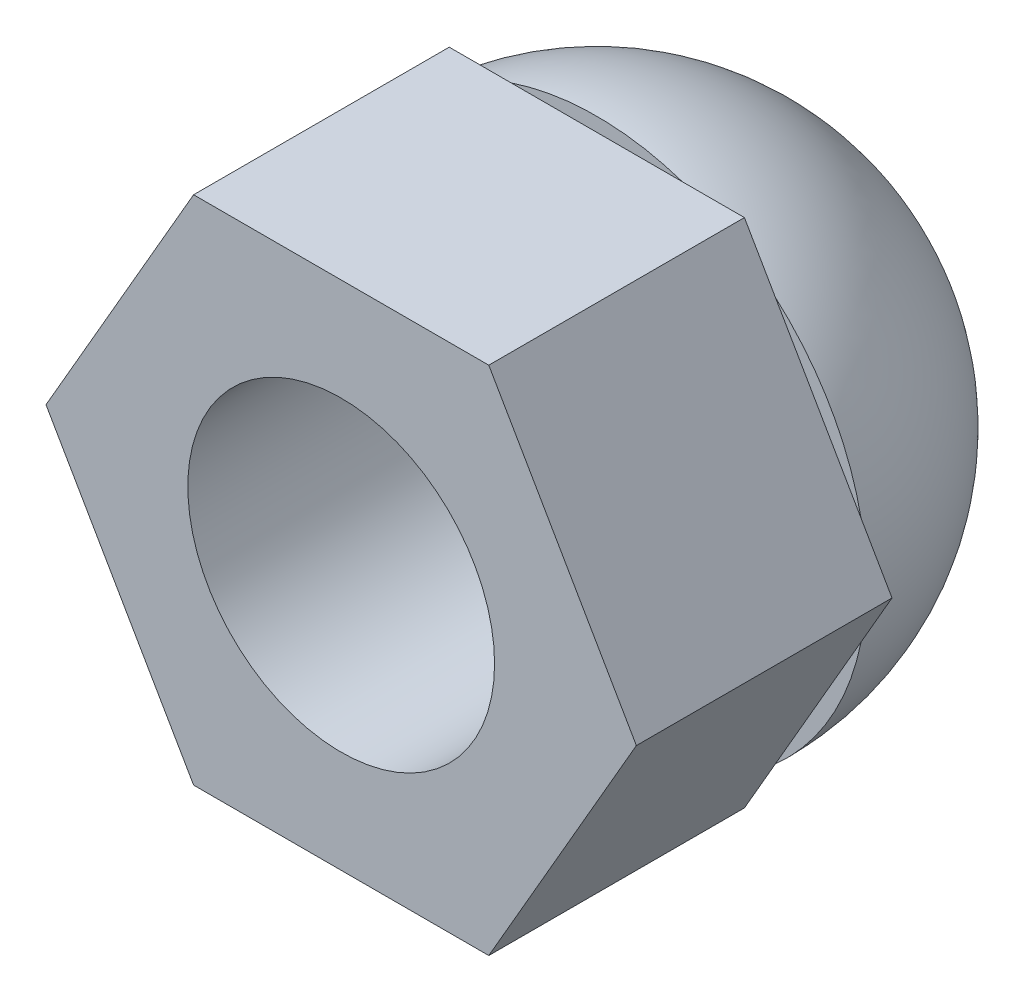
ISO-10303-21;
HEADER;
FILE_DESCRIPTION(('STEP AP214'),'2;1');
FILE_NAME('part.step','',(''),(''),'','','');
FILE_SCHEMA(('AUTOMOTIVE_DESIGN { 1 0 10303 214 1 1 1 1 }'));
ENDSEC;
DATA;
#1=APPLICATION_CONTEXT('core data for automotive mechanical design processes');
#2=APPLICATION_PROTOCOL_DEFINITION('international standard','automotive_design',2000,#1);
#3=PRODUCT_CONTEXT('',#1,'mechanical');
#4=PRODUCT('Part','Part','',(#3));
#5=PRODUCT_RELATED_PRODUCT_CATEGORY('part','',(#4));
#6=PRODUCT_DEFINITION_FORMATION('','',#4);
#7=PRODUCT_DEFINITION_CONTEXT('part definition',#1,'design');
#8=PRODUCT_DEFINITION('design','',#6,#7);
#9=PRODUCT_DEFINITION_SHAPE('','',#8);
#10=(LENGTH_UNIT() NAMED_UNIT(*) SI_UNIT(.MILLI.,.METRE.));
#11=(NAMED_UNIT(*) PLANE_ANGLE_UNIT() SI_UNIT($,.RADIAN.));
#12=(NAMED_UNIT(*) SI_UNIT($,.STERADIAN.) SOLID_ANGLE_UNIT());
#13=UNCERTAINTY_MEASURE_WITH_UNIT(LENGTH_MEASURE(1.E-05),#10,'distance_accuracy_value','');
#14=(GEOMETRIC_REPRESENTATION_CONTEXT(3) GLOBAL_UNCERTAINTY_ASSIGNED_CONTEXT((#13)) GLOBAL_UNIT_ASSIGNED_CONTEXT((#10,
#11,#12)) REPRESENTATION_CONTEXT('',''));
#15=CARTESIAN_POINT('',(0.,0.,0.));
#16=DIRECTION('',(0.,0.,1.));
#17=DIRECTION('',(1.,0.,0.));
#18=AXIS2_PLACEMENT_3D('',#15,#16,#17);
#19=CARTESIAN_POINT('',(0.,0.,0.));
#20=DIRECTION('',(0.,0.,1.));
#21=DIRECTION('',(1.,0.,0.));
#22=AXIS2_PLACEMENT_3D('',#19,#20,#21);
#23=PLANE('',#22);
#24=CARTESIAN_POINT('',(0.,0.,0.));
#25=DIRECTION('',(0.,0.,-1.));
#26=DIRECTION('',(-1.,0.,0.));
#27=AXIS2_PLACEMENT_3D('',#24,#25,#26);
#28=CIRCLE('',#27,5.27350269189626);
#29=CARTESIAN_POINT('',(3.49199954630287,-3.95167936579597,0.));
#30=VERTEX_POINT('',#29);
#31=CARTESIAN_POINT('',(1.67625494523867,-5.,0.));
#32=VERTEX_POINT('',#31);
#33=EDGE_CURVE('E223',#30,#32,#28,.T.);
#34=ORIENTED_EDGE('',*,*,#33,.F.);
#35=DIRECTION('',(0.5,0.866025403784439,0.));
#36=VECTOR('',#35,1.);
#37=CARTESIAN_POINT('',(2.88675134594813,-5.,0.));
#38=LINE('',#37,#36);
#39=CARTESIAN_POINT('',(2.88675134594813,-5.,0.));
#40=VERTEX_POINT('',#39);
#41=EDGE_CURVE('E150',#40,#30,#38,.T.);
#42=ORIENTED_EDGE('',*,*,#41,.F.);
#43=DIRECTION('',(1.,0.,0.));
#44=VECTOR('',#43,1.);
#45=CARTESIAN_POINT('',(-2.88675134594813,-5.,0.));
#46=LINE('',#45,#44);
#47=EDGE_CURVE('E147',#32,#40,#46,.T.);
#48=ORIENTED_EDGE('',*,*,#47,.F.);
#49=EDGE_LOOP('',(#34,#42,#48));
#50=FACE_BOUND('',#49,.T.);
#51=ADVANCED_FACE('F32',(#50),#23,.F.);
#52=CARTESIAN_POINT('',(-1.67625494523866,-5.,0.));
#53=VERTEX_POINT('',#52);
#54=CARTESIAN_POINT('',(-3.49199954630286,-3.95167936579598,0.));
#55=VERTEX_POINT('',#54);
#56=EDGE_CURVE('E231',#53,#55,#28,.T.);
#57=ORIENTED_EDGE('',*,*,#56,.F.);
#58=CARTESIAN_POINT('',(-2.88675134594813,-5.,0.));
#59=VERTEX_POINT('',#58);
#60=EDGE_CURVE('E148',#59,#53,#46,.T.);
#61=ORIENTED_EDGE('',*,*,#60,.F.);
#62=DIRECTION('',(0.5,-0.866025403784438,0.));
#63=VECTOR('',#62,1.);
#64=CARTESIAN_POINT('',(-5.77350269189626,0.,0.));
#65=LINE('',#64,#63);
#66=EDGE_CURVE('E119',#55,#59,#65,.T.);
#67=ORIENTED_EDGE('',*,*,#66,.F.);
#68=EDGE_LOOP('',(#57,#61,#67));
#69=FACE_BOUND('',#68,.T.);
#70=ADVANCED_FACE('F275',(#69),#23,.F.);
#71=CARTESIAN_POINT('',(-5.16825449154152,-1.04832063420402,0.));
#72=VERTEX_POINT('',#71);
#73=CARTESIAN_POINT('',(-5.16825449154153,1.04832063420402,0.));
#74=VERTEX_POINT('',#73);
#75=EDGE_CURVE('E179',#72,#74,#28,.T.);
#76=ORIENTED_EDGE('',*,*,#75,.F.);
#77=CARTESIAN_POINT('',(-5.77350269189626,0.,0.));
#78=VERTEX_POINT('',#77);
#79=EDGE_CURVE('E145',#78,#72,#65,.T.);
#80=ORIENTED_EDGE('',*,*,#79,.F.);
#81=DIRECTION('',(-0.5,-0.866025403784439,0.));
#82=VECTOR('',#81,1.);
#83=CARTESIAN_POINT('',(-2.88675134594813,5.,0.));
#84=LINE('',#83,#82);
#85=EDGE_CURVE('E141',#74,#78,#84,.T.);
#86=ORIENTED_EDGE('',*,*,#85,.F.);
#87=EDGE_LOOP('',(#76,#80,#86));
#88=FACE_BOUND('',#87,.T.);
#89=ADVANCED_FACE('F250',(#88),#23,.F.);
#90=CARTESIAN_POINT('',(-3.49199954630286,3.95167936579597,0.));
#91=VERTEX_POINT('',#90);
#92=CARTESIAN_POINT('',(-1.67625494523867,5.,0.));
#93=VERTEX_POINT('',#92);
#94=EDGE_CURVE('E169',#91,#93,#28,.T.);
#95=ORIENTED_EDGE('',*,*,#94,.F.);
#96=CARTESIAN_POINT('',(-2.88675134594813,5.,0.));
#97=VERTEX_POINT('',#96);
#98=EDGE_CURVE('E142',#97,#91,#84,.T.);
#99=ORIENTED_EDGE('',*,*,#98,.F.);
#100=DIRECTION('',(-1.,0.,0.));
#101=VECTOR('',#100,1.);
#102=CARTESIAN_POINT('',(2.88675134594813,5.,0.));
#103=LINE('',#102,#101);
#104=EDGE_CURVE('E136',#93,#97,#103,.T.);
#105=ORIENTED_EDGE('',*,*,#104,.F.);
#106=EDGE_LOOP('',(#95,#99,#105));
#107=FACE_BOUND('',#106,.T.);
#108=ADVANCED_FACE('F165',(#107),#23,.F.);
#109=CARTESIAN_POINT('',(1.67625494523867,5.,0.));
#110=VERTEX_POINT('',#109);
#111=CARTESIAN_POINT('',(3.49199954630286,3.95167936579598,0.));
#112=VERTEX_POINT('',#111);
#113=EDGE_CURVE('E180',#110,#112,#28,.T.);
#114=ORIENTED_EDGE('',*,*,#113,.F.);
#115=CARTESIAN_POINT('',(2.88675134594813,5.,0.));
#116=VERTEX_POINT('',#115);
#117=EDGE_CURVE('E138',#116,#110,#103,.T.);
#118=ORIENTED_EDGE('',*,*,#117,.F.);
#119=DIRECTION('',(-0.500000000000001,0.866025403784438,0.));
#120=VECTOR('',#119,1.);
#121=CARTESIAN_POINT('',(5.77350269189626,0.,0.));
#122=LINE('',#121,#120);
#123=EDGE_CURVE('E137',#112,#116,#122,.T.);
#124=ORIENTED_EDGE('',*,*,#123,.F.);
#125=EDGE_LOOP('',(#114,#118,#124));
#126=FACE_BOUND('',#125,.T.);
#127=ADVANCED_FACE('F217',(#126),#23,.F.);
#128=CARTESIAN_POINT('',(0.,0.,5.));
#129=DIRECTION('',(0.,0.,1.));
#130=DIRECTION('',(1.,0.,0.));
#131=AXIS2_PLACEMENT_3D('',#128,#129,#130);
#132=PLANE('',#131);
#133=DIRECTION('',(-0.500000000000001,0.866025403784438,0.));
#134=VECTOR('',#133,1.);
#135=CARTESIAN_POINT('',(5.77350269189626,0.,5.));
#136=LINE('',#135,#134);
#137=CARTESIAN_POINT('',(5.77350269189626,0.,5.));
#138=VERTEX_POINT('',#137);
#139=CARTESIAN_POINT('',(2.88675134594813,5.,5.));
#140=VERTEX_POINT('',#139);
#141=EDGE_CURVE('E153',#138,#140,#136,.T.);
#142=ORIENTED_EDGE('',*,*,#141,.T.);
#143=DIRECTION('',(-1.,0.,0.));
#144=VECTOR('',#143,1.);
#145=CARTESIAN_POINT('',(2.88675134594813,5.,5.));
#146=LINE('',#145,#144);
#147=CARTESIAN_POINT('',(-2.88675134594813,5.,5.));
#148=VERTEX_POINT('',#147);
#149=EDGE_CURVE('E91',#140,#148,#146,.T.);
#150=ORIENTED_EDGE('',*,*,#149,.T.);
#151=DIRECTION('',(-0.5,-0.866025403784439,0.));
#152=VECTOR('',#151,1.);
#153=CARTESIAN_POINT('',(-2.88675134594813,5.,5.));
#154=LINE('',#153,#152);
#155=CARTESIAN_POINT('',(-5.77350269189626,0.,5.));
#156=VERTEX_POINT('',#155);
#157=EDGE_CURVE('E108',#148,#156,#154,.T.);
#158=ORIENTED_EDGE('',*,*,#157,.T.);
#159=DIRECTION('',(0.5,-0.866025403784438,0.));
#160=VECTOR('',#159,1.);
#161=CARTESIAN_POINT('',(-5.77350269189626,0.,5.));
#162=LINE('',#161,#160);
#163=CARTESIAN_POINT('',(-2.88675134594813,-5.,5.));
#164=VERTEX_POINT('',#163);
#165=EDGE_CURVE('E100',#156,#164,#162,.T.);
#166=ORIENTED_EDGE('',*,*,#165,.T.);
#167=DIRECTION('',(1.,0.,0.));
#168=VECTOR('',#167,1.);
#169=CARTESIAN_POINT('',(-2.88675134594813,-5.,5.));
#170=LINE('',#169,#168);
#171=CARTESIAN_POINT('',(2.88675134594813,-5.,5.));
#172=VERTEX_POINT('',#171);
#173=EDGE_CURVE('E105',#164,#172,#170,.T.);
#174=ORIENTED_EDGE('',*,*,#173,.T.);
#175=DIRECTION('',(0.5,0.866025403784439,0.));
#176=VECTOR('',#175,1.);
#177=CARTESIAN_POINT('',(2.88675134594813,-5.,5.));
#178=LINE('',#177,#176);
#179=EDGE_CURVE('E56',#172,#138,#178,.T.);
#180=ORIENTED_EDGE('',*,*,#179,.T.);
#181=EDGE_LOOP('',(#142,#150,#158,#166,#174,#180));
#182=FACE_BOUND('',#181,.T.);
#183=CARTESIAN_POINT('',(0.,0.,5.));
#184=DIRECTION('',(0.,0.,1.));
#185=DIRECTION('',(1.,0.,0.));
#186=AXIS2_PLACEMENT_3D('',#183,#184,#185);
#187=CIRCLE('',#186,3.);
#188=CARTESIAN_POINT('',(3.,0.,5.));
#189=VERTEX_POINT('',#188);
#190=EDGE_CURVE('E199',#189,#189,#187,.T.);
#191=ORIENTED_EDGE('',*,*,#190,.F.);
#192=EDGE_LOOP('',(#191));
#193=FACE_BOUND('',#192,.T.);
#194=ADVANCED_FACE('F102',(#182,#193),#132,.T.);
#195=CARTESIAN_POINT('',(5.16825449154152,1.04832063420403,0.));
#196=VERTEX_POINT('',#195);
#197=CARTESIAN_POINT('',(5.16825449154153,-1.04832063420403,0.));
#198=VERTEX_POINT('',#197);
#199=EDGE_CURVE('E47',#196,#198,#28,.T.);
#200=ORIENTED_EDGE('',*,*,#199,.F.);
#201=CARTESIAN_POINT('',(5.77350269189626,0.,0.));
#202=VERTEX_POINT('',#201);
#203=EDGE_CURVE('E133',#202,#196,#122,.T.);
#204=ORIENTED_EDGE('',*,*,#203,.F.);
#205=EDGE_CURVE('E83',#198,#202,#38,.T.);
#206=ORIENTED_EDGE('',*,*,#205,.F.);
#207=EDGE_LOOP('',(#200,#204,#206));
#208=FACE_BOUND('',#207,.T.);
#209=ADVANCED_FACE('F278',(#208),#23,.F.);
#210=CARTESIAN_POINT('',(5.77350269189626,0.,5.));
#211=DIRECTION('',(-0.866025403784438,-0.500000000000001,0.));
#212=DIRECTION('',(0.500000000000001,-0.866025403784438,0.));
#213=AXIS2_PLACEMENT_3D('',#210,#211,#212);
#214=PLANE('',#213);
#215=ORIENTED_EDGE('',*,*,#203,.T.);
#216=DIRECTION('',(0.500000000000001,-0.866025403784438,0.));
#217=VECTOR('',#216,1.);
#218=CARTESIAN_POINT('',(5.77350269189626,0.,0.));
#219=LINE('',#218,#217);
#220=EDGE_CURVE('E195',#112,#196,#219,.T.);
#221=ORIENTED_EDGE('',*,*,#220,.F.);
#222=ORIENTED_EDGE('',*,*,#123,.T.);
#223=DIRECTION('',(0.,0.,-1.));
#224=VECTOR('',#223,1.);
#225=CARTESIAN_POINT('',(2.88675134594813,5.,5.));
#226=LINE('',#225,#224);
#227=EDGE_CURVE('E11',#140,#116,#226,.T.);
#228=ORIENTED_EDGE('',*,*,#227,.F.);
#229=ORIENTED_EDGE('',*,*,#141,.F.);
#230=DIRECTION('',(0.,0.,-1.));
#231=VECTOR('',#230,1.);
#232=CARTESIAN_POINT('',(5.77350269189626,0.,5.));
#233=LINE('',#232,#231);
#234=EDGE_CURVE('E129',#138,#202,#233,.T.);
#235=ORIENTED_EDGE('',*,*,#234,.T.);
#236=EDGE_LOOP('',(#215,#221,#222,#228,#229,#235));
#237=FACE_BOUND('',#236,.T.);
#238=ADVANCED_FACE('F34',(#237),#214,.F.);
#239=CARTESIAN_POINT('',(2.88675134594813,5.,5.));
#240=DIRECTION('',(0.,-1.,0.));
#241=DIRECTION('',(1.,0.,0.));
#242=AXIS2_PLACEMENT_3D('',#239,#240,#241);
#243=PLANE('',#242);
#244=ORIENTED_EDGE('',*,*,#117,.T.);
#245=DIRECTION('',(1.,0.,0.));
#246=VECTOR('',#245,1.);
#247=CARTESIAN_POINT('',(2.88675134594813,5.,0.));
#248=LINE('',#247,#246);
#249=EDGE_CURVE('E192',#93,#110,#248,.T.);
#250=ORIENTED_EDGE('',*,*,#249,.F.);
#251=ORIENTED_EDGE('',*,*,#104,.T.);
#252=DIRECTION('',(0.,0.,-1.));
#253=VECTOR('',#252,1.);
#254=CARTESIAN_POINT('',(-2.88675134594813,5.,5.));
#255=LINE('',#254,#253);
#256=EDGE_CURVE('E40',#148,#97,#255,.T.);
#257=ORIENTED_EDGE('',*,*,#256,.F.);
#258=ORIENTED_EDGE('',*,*,#149,.F.);
#259=ORIENTED_EDGE('',*,*,#227,.T.);
#260=EDGE_LOOP('',(#244,#250,#251,#257,#258,#259));
#261=FACE_BOUND('',#260,.T.);
#262=ADVANCED_FACE('F211',(#261),#243,.F.);
#263=CARTESIAN_POINT('',(-2.88675134594813,5.,5.));
#264=DIRECTION('',(0.866025403784439,-0.5,0.));
#265=DIRECTION('',(0.5,0.866025403784439,0.));
#266=AXIS2_PLACEMENT_3D('',#263,#264,#265);
#267=PLANE('',#266);
#268=ORIENTED_EDGE('',*,*,#98,.T.);
#269=DIRECTION('',(0.5,0.866025403784439,0.));
#270=VECTOR('',#269,1.);
#271=CARTESIAN_POINT('',(-2.88675134594813,5.,0.));
#272=LINE('',#271,#270);
#273=EDGE_CURVE('E190',#74,#91,#272,.T.);
#274=ORIENTED_EDGE('',*,*,#273,.F.);
#275=ORIENTED_EDGE('',*,*,#85,.T.);
#276=DIRECTION('',(0.,0.,-1.));
#277=VECTOR('',#276,1.);
#278=CARTESIAN_POINT('',(-5.77350269189626,0.,5.));
#279=LINE('',#278,#277);
#280=EDGE_CURVE('E123',#156,#78,#279,.T.);
#281=ORIENTED_EDGE('',*,*,#280,.F.);
#282=ORIENTED_EDGE('',*,*,#157,.F.);
#283=ORIENTED_EDGE('',*,*,#256,.T.);
#284=EDGE_LOOP('',(#268,#274,#275,#281,#282,#283));
#285=FACE_BOUND('',#284,.T.);
#286=ADVANCED_FACE('F159',(#285),#267,.F.);
#287=CARTESIAN_POINT('',(-5.77350269189626,0.,5.));
#288=DIRECTION('',(0.866025403784439,0.5,0.));
#289=DIRECTION('',(-0.5,0.866025403784439,0.));
#290=AXIS2_PLACEMENT_3D('',#287,#288,#289);
#291=PLANE('',#290);
#292=ORIENTED_EDGE('',*,*,#79,.T.);
#293=DIRECTION('',(-0.5,0.866025403784439,0.));
#294=VECTOR('',#293,1.);
#295=CARTESIAN_POINT('',(-5.77350269189626,0.,0.));
#296=LINE('',#295,#294);
#297=EDGE_CURVE('E187',#55,#72,#296,.T.);
#298=ORIENTED_EDGE('',*,*,#297,.F.);
#299=ORIENTED_EDGE('',*,*,#66,.T.);
#300=DIRECTION('',(0.,0.,-1.));
#301=VECTOR('',#300,1.);
#302=CARTESIAN_POINT('',(-2.88675134594813,-5.,5.));
#303=LINE('',#302,#301);
#304=EDGE_CURVE('E114',#164,#59,#303,.T.);
#305=ORIENTED_EDGE('',*,*,#304,.F.);
#306=ORIENTED_EDGE('',*,*,#165,.F.);
#307=ORIENTED_EDGE('',*,*,#280,.T.);
#308=EDGE_LOOP('',(#292,#298,#299,#305,#306,#307));
#309=FACE_BOUND('',#308,.T.);
#310=ADVANCED_FACE('F116',(#309),#291,.F.);
#311=CARTESIAN_POINT('',(-2.88675134594813,-5.,5.));
#312=DIRECTION('',(0.,1.,0.));
#313=DIRECTION('',(-1.,0.,0.));
#314=AXIS2_PLACEMENT_3D('',#311,#312,#313);
#315=PLANE('',#314);
#316=ORIENTED_EDGE('',*,*,#60,.T.);
#317=DIRECTION('',(-1.,0.,0.));
#318=VECTOR('',#317,1.);
#319=CARTESIAN_POINT('',(-2.88675134594813,-5.,0.));
#320=LINE('',#319,#318);
#321=EDGE_CURVE('E184',#32,#53,#320,.T.);
#322=ORIENTED_EDGE('',*,*,#321,.F.);
#323=ORIENTED_EDGE('',*,*,#47,.T.);
#324=DIRECTION('',(0.,0.,-1.));
#325=VECTOR('',#324,1.);
#326=CARTESIAN_POINT('',(2.88675134594813,-5.,5.));
#327=LINE('',#326,#325);
#328=EDGE_CURVE('E124',#172,#40,#327,.T.);
#329=ORIENTED_EDGE('',*,*,#328,.F.);
#330=ORIENTED_EDGE('',*,*,#173,.F.);
#331=ORIENTED_EDGE('',*,*,#304,.T.);
#332=EDGE_LOOP('',(#316,#322,#323,#329,#330,#331));
#333=FACE_BOUND('',#332,.T.);
#334=ADVANCED_FACE('F126',(#333),#315,.F.);
#335=CARTESIAN_POINT('',(2.88675134594813,-5.,5.));
#336=DIRECTION('',(-0.866025403784439,0.5,0.));
#337=DIRECTION('',(-0.5,-0.866025403784439,0.));
#338=AXIS2_PLACEMENT_3D('',#335,#336,#337);
#339=PLANE('',#338);
#340=ORIENTED_EDGE('',*,*,#41,.T.);
#341=DIRECTION('',(-0.5,-0.866025403784439,0.));
#342=VECTOR('',#341,1.);
#343=CARTESIAN_POINT('',(2.88675134594813,-5.,0.));
#344=LINE('',#343,#342);
#345=EDGE_CURVE('E178',#198,#30,#344,.T.);
#346=ORIENTED_EDGE('',*,*,#345,.F.);
#347=ORIENTED_EDGE('',*,*,#205,.T.);
#348=ORIENTED_EDGE('',*,*,#234,.F.);
#349=ORIENTED_EDGE('',*,*,#179,.F.);
#350=ORIENTED_EDGE('',*,*,#328,.T.);
#351=EDGE_LOOP('',(#340,#346,#347,#348,#349,#350));
#352=FACE_BOUND('',#351,.T.);
#353=ADVANCED_FACE('F319',(#352),#339,.F.);
#354=CARTESIAN_POINT('',(0.,0.,5.));
#355=DIRECTION('',(0.,0.,-1.));
#356=DIRECTION('',(-1.,0.,0.));
#357=AXIS2_PLACEMENT_3D('',#354,#355,#356);
#358=CYLINDRICAL_SURFACE('',#357,3.);
#359=ORIENTED_EDGE('',*,*,#190,.T.);
#360=EDGE_LOOP('',(#359));
#361=FACE_BOUND('',#360,.T.);
#362=CARTESIAN_POINT('',(0.,0.,0.));
#363=DIRECTION('',(0.,0.,1.));
#364=DIRECTION('',(1.,0.,0.));
#365=AXIS2_PLACEMENT_3D('',#362,#363,#364);
#366=CIRCLE('',#365,3.);
#367=CARTESIAN_POINT('',(3.,0.,0.));
#368=VERTEX_POINT('',#367);
#369=EDGE_CURVE('E198',#368,#368,#366,.T.);
#370=ORIENTED_EDGE('',*,*,#369,.F.);
#371=EDGE_LOOP('',(#370));
#372=FACE_BOUND('',#371,.T.);
#373=ADVANCED_FACE('F314',(#361,#372),#358,.F.);
#374=CARTESIAN_POINT('',(0.,0.,0.));
#375=DIRECTION('',(0.,0.,-1.));
#376=DIRECTION('',(-1.,0.,0.));
#377=AXIS2_PLACEMENT_3D('',#374,#375,#376);
#378=PLANE('',#377);
#379=ORIENTED_EDGE('',*,*,#369,.T.);
#380=EDGE_LOOP('',(#379));
#381=FACE_BOUND('',#380,.T.);
#382=ADVANCED_FACE('F269',(#381),#378,.F.);
#383=EDGE_CURVE('E219',#112,#196,#28,.T.);
#384=ORIENTED_EDGE('',*,*,#383,.F.);
#385=ORIENTED_EDGE('',*,*,#220,.T.);
#386=EDGE_LOOP('',(#384,#385));
#387=FACE_BOUND('',#386,.T.);
#388=ADVANCED_FACE('F262',(#387),#378,.F.);
#389=EDGE_CURVE('E176',#93,#110,#28,.T.);
#390=ORIENTED_EDGE('',*,*,#389,.F.);
#391=ORIENTED_EDGE('',*,*,#249,.T.);
#392=EDGE_LOOP('',(#390,#391));
#393=FACE_BOUND('',#392,.T.);
#394=ADVANCED_FACE('F260',(#393),#378,.F.);
#395=EDGE_CURVE('E175',#74,#91,#28,.T.);
#396=ORIENTED_EDGE('',*,*,#395,.F.);
#397=ORIENTED_EDGE('',*,*,#273,.T.);
#398=EDGE_LOOP('',(#396,#397));
#399=FACE_BOUND('',#398,.T.);
#400=ADVANCED_FACE('F249',(#399),#378,.F.);
#401=EDGE_CURVE('E236',#55,#72,#28,.T.);
#402=ORIENTED_EDGE('',*,*,#401,.F.);
#403=ORIENTED_EDGE('',*,*,#297,.T.);
#404=EDGE_LOOP('',(#402,#403));
#405=FACE_BOUND('',#404,.T.);
#406=ADVANCED_FACE('F268',(#405),#378,.F.);
#407=EDGE_CURVE('E227',#32,#53,#28,.T.);
#408=ORIENTED_EDGE('',*,*,#407,.F.);
#409=ORIENTED_EDGE('',*,*,#321,.T.);
#410=EDGE_LOOP('',(#408,#409));
#411=FACE_BOUND('',#410,.T.);
#412=ADVANCED_FACE('F378',(#411),#378,.F.);
#413=EDGE_CURVE('E222',#198,#30,#28,.T.);
#414=ORIENTED_EDGE('',*,*,#413,.F.);
#415=ORIENTED_EDGE('',*,*,#345,.T.);
#416=EDGE_LOOP('',(#414,#415));
#417=FACE_BOUND('',#416,.T.);
#418=ADVANCED_FACE('F271',(#417),#378,.F.);
#419=CARTESIAN_POINT('',(0.,0.,0.));
#420=DIRECTION('',(0.,0.,-1.));
#421=DIRECTION('',(1.,0.,0.));
#422=AXIS2_PLACEMENT_3D('',#419,#420,#421);
#423=SPHERICAL_SURFACE('',#422,5.27350269189626);
#424=ORIENTED_EDGE('',*,*,#395,.T.);
#425=ORIENTED_EDGE('',*,*,#94,.T.);
#426=ORIENTED_EDGE('',*,*,#389,.T.);
#427=ORIENTED_EDGE('',*,*,#113,.T.);
#428=ORIENTED_EDGE('',*,*,#383,.T.);
#429=ORIENTED_EDGE('',*,*,#199,.T.);
#430=ORIENTED_EDGE('',*,*,#413,.T.);
#431=ORIENTED_EDGE('',*,*,#33,.T.);
#432=ORIENTED_EDGE('',*,*,#407,.T.);
#433=ORIENTED_EDGE('',*,*,#56,.T.);
#434=ORIENTED_EDGE('',*,*,#401,.T.);
#435=ORIENTED_EDGE('',*,*,#75,.T.);
#436=EDGE_LOOP('',(#424,#425,#426,#427,#428,#429,#430,#431,#432,#433,#434,#435));
#437=FACE_BOUND('',#436,.T.);
#438=ADVANCED_FACE('F243',(#437),#423,.T.);
#439=CLOSED_SHELL('',(#51,#70,#89,#108,#127,#194,#209,#238,#262,#286,#310,#334,#353,#373,#382,
#388,#394,#400,#406,#412,#418,#438));
#440=MANIFOLD_SOLID_BREP('B2',#439);
#441=ADVANCED_BREP_SHAPE_REPRESENTATION('',(#18,#440),#14);
#442=SHAPE_DEFINITION_REPRESENTATION(#9,#441);
ENDSEC;
END-ISO-10303-21;
